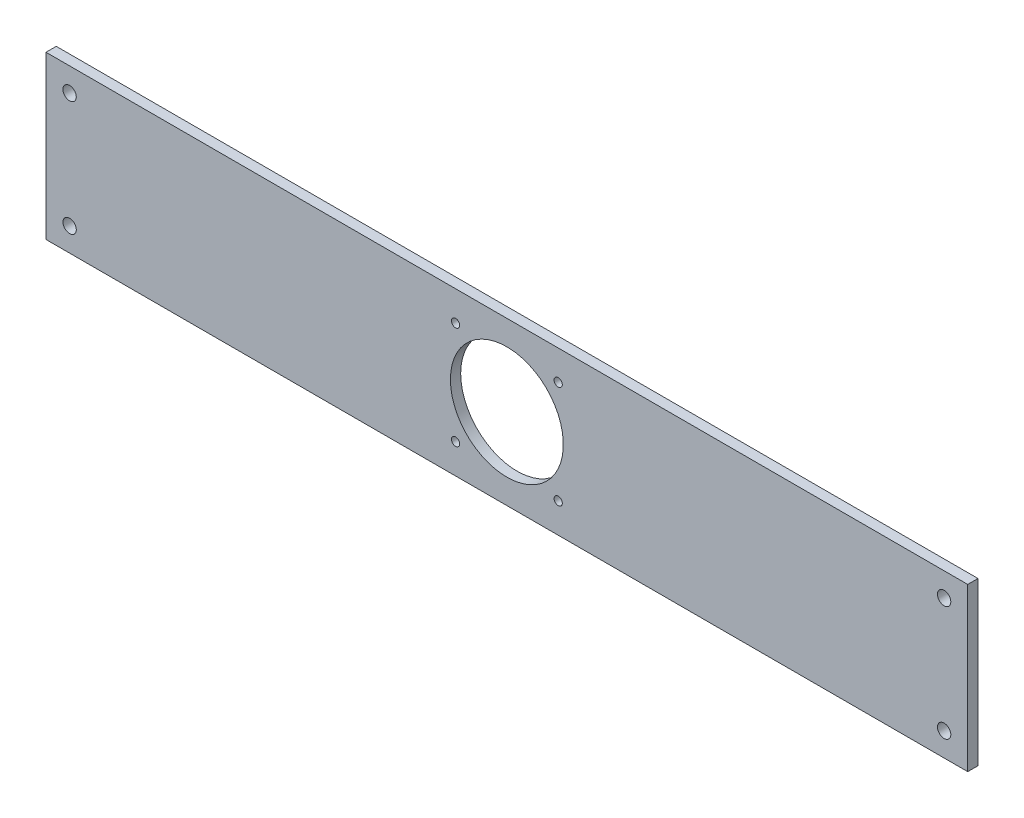
ISO-10303-21;
HEADER;
FILE_DESCRIPTION(('STEP AP214'),'2;1');
FILE_NAME('part.step','',(''),(''),'','','');
FILE_SCHEMA(('AUTOMOTIVE_DESIGN { 1 0 10303 214 1 1 1 1 }'));
ENDSEC;
DATA;
#1=APPLICATION_CONTEXT('core data for automotive mechanical design processes');
#2=APPLICATION_PROTOCOL_DEFINITION('international standard','automotive_design',2000,#1);
#3=PRODUCT_CONTEXT('',#1,'mechanical');
#4=PRODUCT('Part','Part','',(#3));
#5=PRODUCT_RELATED_PRODUCT_CATEGORY('part','',(#4));
#6=PRODUCT_DEFINITION_FORMATION('','',#4);
#7=PRODUCT_DEFINITION_CONTEXT('part definition',#1,'design');
#8=PRODUCT_DEFINITION('design','',#6,#7);
#9=PRODUCT_DEFINITION_SHAPE('','',#8);
#10=(LENGTH_UNIT() NAMED_UNIT(*) SI_UNIT(.MILLI.,.METRE.));
#11=(NAMED_UNIT(*) PLANE_ANGLE_UNIT() SI_UNIT($,.RADIAN.));
#12=(NAMED_UNIT(*) SI_UNIT($,.STERADIAN.) SOLID_ANGLE_UNIT());
#13=UNCERTAINTY_MEASURE_WITH_UNIT(LENGTH_MEASURE(1.E-05),#10,'distance_accuracy_value','');
#14=(GEOMETRIC_REPRESENTATION_CONTEXT(3) GLOBAL_UNCERTAINTY_ASSIGNED_CONTEXT((#13)) GLOBAL_UNIT_ASSIGNED_CONTEXT((#10,
#11,#12)) REPRESENTATION_CONTEXT('',''));
#15=CARTESIAN_POINT('',(0.,0.,0.));
#16=DIRECTION('',(0.,0.,1.));
#17=DIRECTION('',(1.,0.,0.));
#18=AXIS2_PLACEMENT_3D('',#15,#16,#17);
#19=CARTESIAN_POINT('',(0.,0.,5.));
#20=DIRECTION('',(0.,0.,-1.));
#21=DIRECTION('',(-1.,0.,0.));
#22=AXIS2_PLACEMENT_3D('',#19,#20,#21);
#23=PLANE('',#22);
#24=CARTESIAN_POINT('',(224.5,39.5,5.));
#25=DIRECTION('',(0.,0.,-1.));
#26=DIRECTION('',(-1.,0.,0.));
#27=AXIS2_PLACEMENT_3D('',#24,#25,#26);
#28=CIRCLE('',#27,27.5);
#29=CARTESIAN_POINT('',(197.,39.5,5.));
#30=VERTEX_POINT('',#29);
#31=EDGE_CURVE('E166',#30,#30,#28,.T.);
#32=ORIENTED_EDGE('',*,*,#31,.T.);
#33=EDGE_LOOP('',(#32));
#34=FACE_BOUND('',#33,.T.);
#35=CARTESIAN_POINT('',(249.5,64.5,5.));
#36=DIRECTION('',(0.,0.,-1.));
#37=DIRECTION('',(-1.,0.,0.));
#38=AXIS2_PLACEMENT_3D('',#35,#36,#37);
#39=CIRCLE('',#38,2.);
#40=CARTESIAN_POINT('',(247.5,64.5,5.));
#41=VERTEX_POINT('',#40);
#42=EDGE_CURVE('E165',#41,#41,#39,.T.);
#43=ORIENTED_EDGE('',*,*,#42,.T.);
#44=EDGE_LOOP('',(#43));
#45=FACE_BOUND('',#44,.T.);
#46=CARTESIAN_POINT('',(199.5,64.5,5.));
#47=DIRECTION('',(0.,0.,-1.));
#48=DIRECTION('',(-1.,0.,0.));
#49=AXIS2_PLACEMENT_3D('',#46,#47,#48);
#50=CIRCLE('',#49,2.);
#51=CARTESIAN_POINT('',(197.5,64.5,5.));
#52=VERTEX_POINT('',#51);
#53=EDGE_CURVE('E177',#52,#52,#50,.T.);
#54=ORIENTED_EDGE('',*,*,#53,.T.);
#55=EDGE_LOOP('',(#54));
#56=FACE_BOUND('',#55,.T.);
#57=CARTESIAN_POINT('',(249.5,14.5,5.));
#58=DIRECTION('',(0.,0.,-1.));
#59=DIRECTION('',(-1.,0.,0.));
#60=AXIS2_PLACEMENT_3D('',#57,#58,#59);
#61=CIRCLE('',#60,2.);
#62=CARTESIAN_POINT('',(247.5,14.5,5.));
#63=VERTEX_POINT('',#62);
#64=EDGE_CURVE('E188',#63,#63,#61,.T.);
#65=ORIENTED_EDGE('',*,*,#64,.T.);
#66=EDGE_LOOP('',(#65));
#67=FACE_BOUND('',#66,.T.);
#68=CARTESIAN_POINT('',(199.5,14.5,5.));
#69=DIRECTION('',(0.,0.,-1.));
#70=DIRECTION('',(-1.,0.,0.));
#71=AXIS2_PLACEMENT_3D('',#68,#69,#70);
#72=CIRCLE('',#71,2.);
#73=CARTESIAN_POINT('',(197.5,14.5,5.));
#74=VERTEX_POINT('',#73);
#75=EDGE_CURVE('E187',#74,#74,#72,.T.);
#76=ORIENTED_EDGE('',*,*,#75,.T.);
#77=EDGE_LOOP('',(#76));
#78=FACE_BOUND('',#77,.T.);
#79=DIRECTION('',(1.,0.,0.));
#80=VECTOR('',#79,1.);
#81=CARTESIAN_POINT('',(449.,0.,5.));
#82=LINE('',#81,#80);
#83=CARTESIAN_POINT('',(0.,0.,5.));
#84=VERTEX_POINT('',#83);
#85=CARTESIAN_POINT('',(449.,0.,5.));
#86=VERTEX_POINT('',#85);
#87=EDGE_CURVE('E99',#84,#86,#82,.T.);
#88=ORIENTED_EDGE('',*,*,#87,.T.);
#89=DIRECTION('',(0.,1.,0.));
#90=VECTOR('',#89,1.);
#91=CARTESIAN_POINT('',(449.,79.,5.));
#92=LINE('',#91,#90);
#93=CARTESIAN_POINT('',(449.,79.,5.));
#94=VERTEX_POINT('',#93);
#95=EDGE_CURVE('E94',#86,#94,#92,.T.);
#96=ORIENTED_EDGE('',*,*,#95,.T.);
#97=DIRECTION('',(-1.,0.,0.));
#98=VECTOR('',#97,1.);
#99=CARTESIAN_POINT('',(0.,79.,5.));
#100=LINE('',#99,#98);
#101=CARTESIAN_POINT('',(0.,79.,5.));
#102=VERTEX_POINT('',#101);
#103=EDGE_CURVE('E97',#94,#102,#100,.T.);
#104=ORIENTED_EDGE('',*,*,#103,.T.);
#105=DIRECTION('',(0.,-1.,0.));
#106=VECTOR('',#105,1.);
#107=CARTESIAN_POINT('',(0.,0.,5.));
#108=LINE('',#107,#106);
#109=EDGE_CURVE('E62',#102,#84,#108,.T.);
#110=ORIENTED_EDGE('',*,*,#109,.T.);
#111=EDGE_LOOP('',(#88,#96,#104,#110));
#112=FACE_BOUND('',#111,.T.);
#113=CARTESIAN_POINT('',(11.5,67.5,5.));
#114=DIRECTION('',(0.,0.,1.));
#115=DIRECTION('',(1.,0.,0.));
#116=AXIS2_PLACEMENT_3D('',#113,#114,#115);
#117=CIRCLE('',#116,3.25);
#118=CARTESIAN_POINT('',(14.75,67.5,5.));
#119=VERTEX_POINT('',#118);
#120=EDGE_CURVE('E114',#119,#119,#117,.T.);
#121=ORIENTED_EDGE('',*,*,#120,.F.);
#122=EDGE_LOOP('',(#121));
#123=FACE_BOUND('',#122,.T.);
#124=CARTESIAN_POINT('',(437.5,67.5,5.));
#125=DIRECTION('',(0.,0.,1.));
#126=DIRECTION('',(-1.,0.,0.));
#127=AXIS2_PLACEMENT_3D('',#124,#125,#126);
#128=CIRCLE('',#127,3.24999999999995);
#129=CARTESIAN_POINT('',(434.25,67.5,5.));
#130=VERTEX_POINT('',#129);
#131=EDGE_CURVE('E131',#130,#130,#128,.T.);
#132=ORIENTED_EDGE('',*,*,#131,.F.);
#133=EDGE_LOOP('',(#132));
#134=FACE_BOUND('',#133,.T.);
#135=CARTESIAN_POINT('',(11.5,11.5,5.));
#136=DIRECTION('',(0.,0.,1.));
#137=DIRECTION('',(-1.,0.,0.));
#138=AXIS2_PLACEMENT_3D('',#135,#136,#137);
#139=CIRCLE('',#138,3.25);
#140=CARTESIAN_POINT('',(8.25,11.5,5.));
#141=VERTEX_POINT('',#140);
#142=EDGE_CURVE('E152',#141,#141,#139,.T.);
#143=ORIENTED_EDGE('',*,*,#142,.F.);
#144=EDGE_LOOP('',(#143));
#145=FACE_BOUND('',#144,.T.);
#146=CARTESIAN_POINT('',(437.5,11.5,5.));
#147=DIRECTION('',(0.,0.,1.));
#148=DIRECTION('',(1.,0.,0.));
#149=AXIS2_PLACEMENT_3D('',#146,#147,#148);
#150=CIRCLE('',#149,3.24999999999995);
#151=CARTESIAN_POINT('',(440.75,11.5,5.));
#152=VERTEX_POINT('',#151);
#153=EDGE_CURVE('E153',#152,#152,#150,.T.);
#154=ORIENTED_EDGE('',*,*,#153,.F.);
#155=EDGE_LOOP('',(#154));
#156=FACE_BOUND('',#155,.T.);
#157=ADVANCED_FACE('F45',(#34,#45,#56,#67,#78,#112,#123,#134,#145,#156),#23,.F.);
#158=CARTESIAN_POINT('',(0.,0.,0.));
#159=DIRECTION('',(0.,0.,-1.));
#160=DIRECTION('',(-1.,0.,0.));
#161=AXIS2_PLACEMENT_3D('',#158,#159,#160);
#162=PLANE('',#161);
#163=CARTESIAN_POINT('',(224.5,39.5,0.));
#164=DIRECTION('',(0.,0.,-1.));
#165=DIRECTION('',(-1.,0.,0.));
#166=AXIS2_PLACEMENT_3D('',#163,#164,#165);
#167=CIRCLE('',#166,27.5);
#168=CARTESIAN_POINT('',(197.,39.5,0.));
#169=VERTEX_POINT('',#168);
#170=EDGE_CURVE('E167',#169,#169,#167,.T.);
#171=ORIENTED_EDGE('',*,*,#170,.F.);
#172=EDGE_LOOP('',(#171));
#173=FACE_BOUND('',#172,.T.);
#174=CARTESIAN_POINT('',(249.5,64.5,0.));
#175=DIRECTION('',(0.,0.,-1.));
#176=DIRECTION('',(-1.,0.,0.));
#177=AXIS2_PLACEMENT_3D('',#174,#175,#176);
#178=CIRCLE('',#177,2.);
#179=CARTESIAN_POINT('',(247.5,64.5,0.));
#180=VERTEX_POINT('',#179);
#181=EDGE_CURVE('E159',#180,#180,#178,.T.);
#182=ORIENTED_EDGE('',*,*,#181,.F.);
#183=EDGE_LOOP('',(#182));
#184=FACE_BOUND('',#183,.T.);
#185=CARTESIAN_POINT('',(199.5,64.5,0.));
#186=DIRECTION('',(0.,0.,-1.));
#187=DIRECTION('',(-1.,0.,0.));
#188=AXIS2_PLACEMENT_3D('',#185,#186,#187);
#189=CIRCLE('',#188,2.);
#190=CARTESIAN_POINT('',(197.5,64.5,0.));
#191=VERTEX_POINT('',#190);
#192=EDGE_CURVE('E172',#191,#191,#189,.T.);
#193=ORIENTED_EDGE('',*,*,#192,.F.);
#194=EDGE_LOOP('',(#193));
#195=FACE_BOUND('',#194,.T.);
#196=CARTESIAN_POINT('',(249.5,14.5,0.));
#197=DIRECTION('',(0.,0.,-1.));
#198=DIRECTION('',(-1.,0.,0.));
#199=AXIS2_PLACEMENT_3D('',#196,#197,#198);
#200=CIRCLE('',#199,2.);
#201=CARTESIAN_POINT('',(247.5,14.5,0.));
#202=VERTEX_POINT('',#201);
#203=EDGE_CURVE('E194',#202,#202,#200,.T.);
#204=ORIENTED_EDGE('',*,*,#203,.F.);
#205=EDGE_LOOP('',(#204));
#206=FACE_BOUND('',#205,.T.);
#207=CARTESIAN_POINT('',(199.5,14.5,0.));
#208=DIRECTION('',(0.,0.,-1.));
#209=DIRECTION('',(-1.,0.,0.));
#210=AXIS2_PLACEMENT_3D('',#207,#208,#209);
#211=CIRCLE('',#210,2.);
#212=CARTESIAN_POINT('',(197.5,14.5,0.));
#213=VERTEX_POINT('',#212);
#214=EDGE_CURVE('E181',#213,#213,#211,.T.);
#215=ORIENTED_EDGE('',*,*,#214,.F.);
#216=EDGE_LOOP('',(#215));
#217=FACE_BOUND('',#216,.T.);
#218=CARTESIAN_POINT('',(11.5,11.5,0.));
#219=DIRECTION('',(0.,0.,1.));
#220=DIRECTION('',(-1.,0.,0.));
#221=AXIS2_PLACEMENT_3D('',#218,#219,#220);
#222=CIRCLE('',#221,3.25);
#223=CARTESIAN_POINT('',(8.25,11.5,0.));
#224=VERTEX_POINT('',#223);
#225=EDGE_CURVE('E146',#224,#224,#222,.T.);
#226=ORIENTED_EDGE('',*,*,#225,.T.);
#227=EDGE_LOOP('',(#226));
#228=FACE_BOUND('',#227,.T.);
#229=CARTESIAN_POINT('',(11.5,67.5,0.));
#230=DIRECTION('',(0.,0.,1.));
#231=DIRECTION('',(1.,0.,0.));
#232=AXIS2_PLACEMENT_3D('',#229,#230,#231);
#233=CIRCLE('',#232,3.25);
#234=CARTESIAN_POINT('',(14.75,67.5,0.));
#235=VERTEX_POINT('',#234);
#236=EDGE_CURVE('E126',#235,#235,#233,.T.);
#237=ORIENTED_EDGE('',*,*,#236,.T.);
#238=EDGE_LOOP('',(#237));
#239=FACE_BOUND('',#238,.T.);
#240=DIRECTION('',(1.,0.,0.));
#241=VECTOR('',#240,1.);
#242=CARTESIAN_POINT('',(449.,0.,0.));
#243=LINE('',#242,#241);
#244=CARTESIAN_POINT('',(0.,0.,0.));
#245=VERTEX_POINT('',#244);
#246=CARTESIAN_POINT('',(449.,0.,0.));
#247=VERTEX_POINT('',#246);
#248=EDGE_CURVE('E111',#245,#247,#243,.T.);
#249=ORIENTED_EDGE('',*,*,#248,.F.);
#250=DIRECTION('',(0.,-1.,0.));
#251=VECTOR('',#250,1.);
#252=CARTESIAN_POINT('',(0.,0.,0.));
#253=LINE('',#252,#251);
#254=CARTESIAN_POINT('',(0.,79.,0.));
#255=VERTEX_POINT('',#254);
#256=EDGE_CURVE('E87',#255,#245,#253,.T.);
#257=ORIENTED_EDGE('',*,*,#256,.F.);
#258=DIRECTION('',(-1.,0.,0.));
#259=VECTOR('',#258,1.);
#260=CARTESIAN_POINT('',(0.,79.,0.));
#261=LINE('',#260,#259);
#262=CARTESIAN_POINT('',(449.,79.,0.));
#263=VERTEX_POINT('',#262);
#264=EDGE_CURVE('E81',#263,#255,#261,.T.);
#265=ORIENTED_EDGE('',*,*,#264,.F.);
#266=DIRECTION('',(0.,1.,0.));
#267=VECTOR('',#266,1.);
#268=CARTESIAN_POINT('',(449.,79.,0.));
#269=LINE('',#268,#267);
#270=EDGE_CURVE('E103',#247,#263,#269,.T.);
#271=ORIENTED_EDGE('',*,*,#270,.F.);
#272=EDGE_LOOP('',(#249,#257,#265,#271));
#273=FACE_BOUND('',#272,.T.);
#274=CARTESIAN_POINT('',(437.5,67.5,0.));
#275=DIRECTION('',(0.,0.,1.));
#276=DIRECTION('',(-1.,0.,0.));
#277=AXIS2_PLACEMENT_3D('',#274,#275,#276);
#278=CIRCLE('',#277,3.24999999999995);
#279=CARTESIAN_POINT('',(434.25,67.5,0.));
#280=VERTEX_POINT('',#279);
#281=EDGE_CURVE('E362',#280,#280,#278,.T.);
#282=ORIENTED_EDGE('',*,*,#281,.T.);
#283=EDGE_LOOP('',(#282));
#284=FACE_BOUND('',#283,.T.);
#285=CARTESIAN_POINT('',(437.5,11.5,0.));
#286=DIRECTION('',(0.,0.,1.));
#287=DIRECTION('',(1.,0.,0.));
#288=AXIS2_PLACEMENT_3D('',#285,#286,#287);
#289=CIRCLE('',#288,3.24999999999995);
#290=CARTESIAN_POINT('',(440.75,11.5,0.));
#291=VERTEX_POINT('',#290);
#292=EDGE_CURVE('E371',#291,#291,#289,.T.);
#293=ORIENTED_EDGE('',*,*,#292,.T.);
#294=EDGE_LOOP('',(#293));
#295=FACE_BOUND('',#294,.T.);
#296=ADVANCED_FACE('F122',(#173,#184,#195,#206,#217,#228,#239,#273,#284,#295),#162,.T.);
#297=CARTESIAN_POINT('',(449.,0.,5.));
#298=DIRECTION('',(0.,1.,0.));
#299=DIRECTION('',(-1.,0.,0.));
#300=AXIS2_PLACEMENT_3D('',#297,#298,#299);
#301=PLANE('',#300);
#302=ORIENTED_EDGE('',*,*,#248,.T.);
#303=DIRECTION('',(0.,0.,-1.));
#304=VECTOR('',#303,1.);
#305=CARTESIAN_POINT('',(449.,0.,5.));
#306=LINE('',#305,#304);
#307=EDGE_CURVE('E12',#86,#247,#306,.T.);
#308=ORIENTED_EDGE('',*,*,#307,.F.);
#309=ORIENTED_EDGE('',*,*,#87,.F.);
#310=DIRECTION('',(0.,0.,-1.));
#311=VECTOR('',#310,1.);
#312=CARTESIAN_POINT('',(0.,0.,5.));
#313=LINE('',#312,#311);
#314=EDGE_CURVE('E107',#84,#245,#313,.T.);
#315=ORIENTED_EDGE('',*,*,#314,.T.);
#316=EDGE_LOOP('',(#302,#308,#309,#315));
#317=FACE_BOUND('',#316,.T.);
#318=ADVANCED_FACE('F47',(#317),#301,.F.);
#319=CARTESIAN_POINT('',(449.,79.,5.));
#320=DIRECTION('',(-1.,0.,0.));
#321=DIRECTION('',(0.,0.,1.));
#322=AXIS2_PLACEMENT_3D('',#319,#320,#321);
#323=PLANE('',#322);
#324=ORIENTED_EDGE('',*,*,#270,.T.);
#325=DIRECTION('',(0.,0.,-1.));
#326=VECTOR('',#325,1.);
#327=CARTESIAN_POINT('',(449.,79.,5.));
#328=LINE('',#327,#326);
#329=EDGE_CURVE('E54',#94,#263,#328,.T.);
#330=ORIENTED_EDGE('',*,*,#329,.F.);
#331=ORIENTED_EDGE('',*,*,#95,.F.);
#332=ORIENTED_EDGE('',*,*,#307,.T.);
#333=EDGE_LOOP('',(#324,#330,#331,#332));
#334=FACE_BOUND('',#333,.T.);
#335=ADVANCED_FACE('F102',(#334),#323,.F.);
#336=CARTESIAN_POINT('',(0.,79.,5.));
#337=DIRECTION('',(0.,-1.,0.));
#338=DIRECTION('',(0.,0.,-1.));
#339=AXIS2_PLACEMENT_3D('',#336,#337,#338);
#340=PLANE('',#339);
#341=ORIENTED_EDGE('',*,*,#264,.T.);
#342=DIRECTION('',(0.,0.,-1.));
#343=VECTOR('',#342,1.);
#344=CARTESIAN_POINT('',(0.,79.,5.));
#345=LINE('',#344,#343);
#346=EDGE_CURVE('E104',#102,#255,#345,.T.);
#347=ORIENTED_EDGE('',*,*,#346,.F.);
#348=ORIENTED_EDGE('',*,*,#103,.F.);
#349=ORIENTED_EDGE('',*,*,#329,.T.);
#350=EDGE_LOOP('',(#341,#347,#348,#349));
#351=FACE_BOUND('',#350,.T.);
#352=ADVANCED_FACE('F105',(#351),#340,.F.);
#353=CARTESIAN_POINT('',(0.,0.,5.));
#354=DIRECTION('',(1.,0.,0.));
#355=DIRECTION('',(0.,1.,0.));
#356=AXIS2_PLACEMENT_3D('',#353,#354,#355);
#357=PLANE('',#356);
#358=ORIENTED_EDGE('',*,*,#256,.T.);
#359=ORIENTED_EDGE('',*,*,#314,.F.);
#360=ORIENTED_EDGE('',*,*,#109,.F.);
#361=ORIENTED_EDGE('',*,*,#346,.T.);
#362=EDGE_LOOP('',(#358,#359,#360,#361));
#363=FACE_BOUND('',#362,.T.);
#364=ADVANCED_FACE('F119',(#363),#357,.F.);
#365=CARTESIAN_POINT('',(11.5,67.5,5.));
#366=DIRECTION('',(0.,0.,-1.));
#367=DIRECTION('',(-1.,0.,0.));
#368=AXIS2_PLACEMENT_3D('',#365,#366,#367);
#369=CYLINDRICAL_SURFACE('',#368,3.25);
#370=ORIENTED_EDGE('',*,*,#120,.T.);
#371=EDGE_LOOP('',(#370));
#372=FACE_BOUND('',#371,.T.);
#373=ORIENTED_EDGE('',*,*,#236,.F.);
#374=EDGE_LOOP('',(#373));
#375=FACE_BOUND('',#374,.T.);
#376=ADVANCED_FACE('F226',(#372,#375),#369,.F.);
#377=CARTESIAN_POINT('',(437.5,67.5,5.));
#378=DIRECTION('',(0.,0.,-1.));
#379=DIRECTION('',(-1.,0.,0.));
#380=AXIS2_PLACEMENT_3D('',#377,#378,#379);
#381=CYLINDRICAL_SURFACE('',#380,3.24999999999995);
#382=ORIENTED_EDGE('',*,*,#131,.T.);
#383=EDGE_LOOP('',(#382));
#384=FACE_BOUND('',#383,.T.);
#385=ORIENTED_EDGE('',*,*,#281,.F.);
#386=EDGE_LOOP('',(#385));
#387=FACE_BOUND('',#386,.T.);
#388=ADVANCED_FACE('F228',(#384,#387),#381,.F.);
#389=CARTESIAN_POINT('',(11.5,11.5,5.));
#390=DIRECTION('',(0.,0.,-1.));
#391=DIRECTION('',(-1.,0.,0.));
#392=AXIS2_PLACEMENT_3D('',#389,#390,#391);
#393=CYLINDRICAL_SURFACE('',#392,3.25);
#394=ORIENTED_EDGE('',*,*,#142,.T.);
#395=EDGE_LOOP('',(#394));
#396=FACE_BOUND('',#395,.T.);
#397=ORIENTED_EDGE('',*,*,#225,.F.);
#398=EDGE_LOOP('',(#397));
#399=FACE_BOUND('',#398,.T.);
#400=ADVANCED_FACE('F235',(#396,#399),#393,.F.);
#401=CARTESIAN_POINT('',(437.5,11.5,5.));
#402=DIRECTION('',(0.,0.,-1.));
#403=DIRECTION('',(-1.,0.,0.));
#404=AXIS2_PLACEMENT_3D('',#401,#402,#403);
#405=CYLINDRICAL_SURFACE('',#404,3.24999999999995);
#406=ORIENTED_EDGE('',*,*,#153,.T.);
#407=EDGE_LOOP('',(#406));
#408=FACE_BOUND('',#407,.T.);
#409=ORIENTED_EDGE('',*,*,#292,.F.);
#410=EDGE_LOOP('',(#409));
#411=FACE_BOUND('',#410,.T.);
#412=ADVANCED_FACE('F300',(#408,#411),#405,.F.);
#413=CARTESIAN_POINT('',(199.5,14.5,0.));
#414=DIRECTION('',(0.,0.,-1.));
#415=DIRECTION('',(-1.,0.,0.));
#416=AXIS2_PLACEMENT_3D('',#413,#414,#415);
#417=CYLINDRICAL_SURFACE('',#416,2.);
#418=ORIENTED_EDGE('',*,*,#75,.F.);
#419=EDGE_LOOP('',(#418));
#420=FACE_BOUND('',#419,.T.);
#421=ORIENTED_EDGE('',*,*,#214,.T.);
#422=EDGE_LOOP('',(#421));
#423=FACE_BOUND('',#422,.T.);
#424=ADVANCED_FACE('F292',(#420,#423),#417,.F.);
#425=CARTESIAN_POINT('',(249.5,14.5,0.));
#426=DIRECTION('',(0.,0.,-1.));
#427=DIRECTION('',(-1.,0.,0.));
#428=AXIS2_PLACEMENT_3D('',#425,#426,#427);
#429=CYLINDRICAL_SURFACE('',#428,2.);
#430=ORIENTED_EDGE('',*,*,#64,.F.);
#431=EDGE_LOOP('',(#430));
#432=FACE_BOUND('',#431,.T.);
#433=ORIENTED_EDGE('',*,*,#203,.T.);
#434=EDGE_LOOP('',(#433));
#435=FACE_BOUND('',#434,.T.);
#436=ADVANCED_FACE('F211',(#432,#435),#429,.F.);
#437=CARTESIAN_POINT('',(199.5,64.5,0.));
#438=DIRECTION('',(0.,0.,-1.));
#439=DIRECTION('',(-1.,0.,0.));
#440=AXIS2_PLACEMENT_3D('',#437,#438,#439);
#441=CYLINDRICAL_SURFACE('',#440,2.);
#442=ORIENTED_EDGE('',*,*,#53,.F.);
#443=EDGE_LOOP('',(#442));
#444=FACE_BOUND('',#443,.T.);
#445=ORIENTED_EDGE('',*,*,#192,.T.);
#446=EDGE_LOOP('',(#445));
#447=FACE_BOUND('',#446,.T.);
#448=ADVANCED_FACE('F207',(#444,#447),#441,.F.);
#449=CARTESIAN_POINT('',(249.5,64.5,0.));
#450=DIRECTION('',(0.,0.,-1.));
#451=DIRECTION('',(-1.,0.,0.));
#452=AXIS2_PLACEMENT_3D('',#449,#450,#451);
#453=CYLINDRICAL_SURFACE('',#452,2.);
#454=ORIENTED_EDGE('',*,*,#42,.F.);
#455=EDGE_LOOP('',(#454));
#456=FACE_BOUND('',#455,.T.);
#457=ORIENTED_EDGE('',*,*,#181,.T.);
#458=EDGE_LOOP('',(#457));
#459=FACE_BOUND('',#458,.T.);
#460=ADVANCED_FACE('F210',(#456,#459),#453,.F.);
#461=CARTESIAN_POINT('',(224.5,39.5,5.));
#462=DIRECTION('',(0.,0.,-1.));
#463=DIRECTION('',(-1.,0.,0.));
#464=AXIS2_PLACEMENT_3D('',#461,#462,#463);
#465=CYLINDRICAL_SURFACE('',#464,27.5);
#466=ORIENTED_EDGE('',*,*,#31,.F.);
#467=EDGE_LOOP('',(#466));
#468=FACE_BOUND('',#467,.T.);
#469=ORIENTED_EDGE('',*,*,#170,.T.);
#470=EDGE_LOOP('',(#469));
#471=FACE_BOUND('',#470,.T.);
#472=ADVANCED_FACE('F269',(#468,#471),#465,.F.);
#473=CLOSED_SHELL('',(#157,#296,#318,#335,#352,#364,#376,#388,#400,#412,#424,#436,#448,#460,#472));
#474=MANIFOLD_SOLID_BREP('B2',#473);
#475=ADVANCED_BREP_SHAPE_REPRESENTATION('',(#18,#474),#14);
#476=SHAPE_DEFINITION_REPRESENTATION(#9,#475);
ENDSEC;
END-ISO-10303-21;
